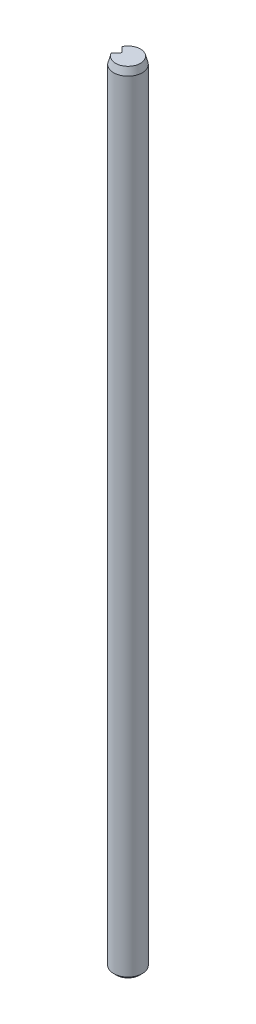
ISO-10303-21;
HEADER;
FILE_DESCRIPTION(('STEP AP214'),'2;1');
FILE_NAME('part.step','',(''),(''),'','','');
FILE_SCHEMA(('AUTOMOTIVE_DESIGN { 1 0 10303 214 1 1 1 1 }'));
ENDSEC;
DATA;
#1=APPLICATION_CONTEXT('core data for automotive mechanical design processes');
#2=APPLICATION_PROTOCOL_DEFINITION('international standard','automotive_design',2000,#1);
#3=PRODUCT_CONTEXT('',#1,'mechanical');
#4=PRODUCT('Part','Part','',(#3));
#5=PRODUCT_RELATED_PRODUCT_CATEGORY('part','',(#4));
#6=PRODUCT_DEFINITION_FORMATION('','',#4);
#7=PRODUCT_DEFINITION_CONTEXT('part definition',#1,'design');
#8=PRODUCT_DEFINITION('design','',#6,#7);
#9=PRODUCT_DEFINITION_SHAPE('','',#8);
#10=(LENGTH_UNIT() NAMED_UNIT(*) SI_UNIT(.MILLI.,.METRE.));
#11=(NAMED_UNIT(*) PLANE_ANGLE_UNIT() SI_UNIT($,.RADIAN.));
#12=(NAMED_UNIT(*) SI_UNIT($,.STERADIAN.) SOLID_ANGLE_UNIT());
#13=UNCERTAINTY_MEASURE_WITH_UNIT(LENGTH_MEASURE(1.E-05),#10,'distance_accuracy_value','');
#14=(GEOMETRIC_REPRESENTATION_CONTEXT(3) GLOBAL_UNCERTAINTY_ASSIGNED_CONTEXT((#13)) GLOBAL_UNIT_ASSIGNED_CONTEXT((#10,
#11,#12)) REPRESENTATION_CONTEXT('',''));
#15=CARTESIAN_POINT('',(0.,0.,0.));
#16=DIRECTION('',(0.,0.,1.));
#17=DIRECTION('',(1.,0.,0.));
#18=AXIS2_PLACEMENT_3D('',#15,#16,#17);
#19=CARTESIAN_POINT('',(0.,55.,0.));
#20=DIRECTION('',(0.,-1.,0.));
#21=DIRECTION('',(0.,0.,-1.));
#22=AXIS2_PLACEMENT_3D('',#19,#20,#21);
#23=CYLINDRICAL_SURFACE('',#22,1.);
#24=DIRECTION('',(0.,1.,0.));
#25=VECTOR('',#24,1.);
#26=CARTESIAN_POINT('',(-0.878280892974548,0.,0.478145033473976));
#27=LINE('',#26,#25);
#28=CARTESIAN_POINT('',(-0.878280892974548,0.199999999999992,0.478145033473976));
#29=VERTEX_POINT('',#28);
#30=CARTESIAN_POINT('',(-0.878280892974548,54.5,0.478145033473976));
#31=VERTEX_POINT('',#30);
#32=EDGE_CURVE('E125',#29,#31,#27,.T.);
#33=ORIENTED_EDGE('',*,*,#32,.F.);
#34=CARTESIAN_POINT('',(0.,0.199999999999992,0.));
#35=DIRECTION('',(0.,1.,0.));
#36=DIRECTION('',(0.,0.,1.));
#37=AXIS2_PLACEMENT_3D('',#34,#35,#36);
#38=CIRCLE('',#37,1.);
#39=CARTESIAN_POINT('',(-0.878280892974548,0.199999999999992,-0.478145033473976));
#40=VERTEX_POINT('',#39);
#41=EDGE_CURVE('E153',#29,#40,#38,.T.);
#42=ORIENTED_EDGE('',*,*,#41,.T.);
#43=DIRECTION('',(0.,1.,0.));
#44=VECTOR('',#43,1.);
#45=CARTESIAN_POINT('',(-0.878280892974548,0.,-0.478145033473976));
#46=LINE('',#45,#44);
#47=CARTESIAN_POINT('',(-0.878280892974548,54.5,-0.478145033473976));
#48=VERTEX_POINT('',#47);
#49=EDGE_CURVE('E111',#40,#48,#46,.T.);
#50=ORIENTED_EDGE('',*,*,#49,.T.);
#51=CARTESIAN_POINT('',(0.,54.5,0.));
#52=DIRECTION('',(0.,1.,0.));
#53=DIRECTION('',(0.,0.,1.));
#54=AXIS2_PLACEMENT_3D('',#51,#52,#53);
#55=CIRCLE('',#54,1.);
#56=EDGE_CURVE('E136',#48,#31,#55,.F.);
#57=ORIENTED_EDGE('',*,*,#56,.T.);
#58=EDGE_LOOP('',(#33,#42,#50,#57));
#59=FACE_BOUND('',#58,.T.);
#60=ADVANCED_FACE('F36',(#59),#23,.T.);
#61=CARTESIAN_POINT('',(0.,55.,0.));
#62=DIRECTION('',(0.,1.,0.));
#63=DIRECTION('',(0.,0.,1.));
#64=AXIS2_PLACEMENT_3D('',#61,#62,#63);
#65=PLANE('',#64);
#66=DIRECTION('',(0.707106781186548,0.,-0.707106781186547));
#67=VECTOR('',#66,1.);
#68=CARTESIAN_POINT('',(-0.400135859500572,55.,0.));
#69=LINE('',#68,#67);
#70=CARTESIAN_POINT('',(-0.778836297480789,55.,0.378700437980217));
#71=VERTEX_POINT('',#70);
#72=CARTESIAN_POINT('',(-0.470846537619226,55.,0.0707106781186547));
#73=VERTEX_POINT('',#72);
#74=EDGE_CURVE('E118',#71,#73,#69,.T.);
#75=ORIENTED_EDGE('',*,*,#74,.F.);
#76=CARTESIAN_POINT('',(0.,55.,0.));
#77=DIRECTION('',(0.,1.,0.));
#78=DIRECTION('',(0.,0.,1.));
#79=AXIS2_PLACEMENT_3D('',#76,#77,#78);
#80=CIRCLE('',#79,0.866025403784434);
#81=CARTESIAN_POINT('',(-0.778836297480789,55.,-0.378700437980217));
#82=VERTEX_POINT('',#81);
#83=EDGE_CURVE('E116',#71,#82,#80,.T.);
#84=ORIENTED_EDGE('',*,*,#83,.T.);
#85=DIRECTION('',(-0.707106781186548,0.,-0.707106781186547));
#86=VECTOR('',#85,1.);
#87=CARTESIAN_POINT('',(-0.878280892974548,55.,-0.478145033473976));
#88=LINE('',#87,#86);
#89=CARTESIAN_POINT('',(-0.470846537619226,55.,-0.0707106781186547));
#90=VERTEX_POINT('',#89);
#91=EDGE_CURVE('E109',#90,#82,#88,.T.);
#92=ORIENTED_EDGE('',*,*,#91,.F.);
#93=CARTESIAN_POINT('',(-0.541557215737881,55.,0.));
#94=DIRECTION('',(0.,1.,0.));
#95=DIRECTION('',(0.,0.,1.));
#96=AXIS2_PLACEMENT_3D('',#93,#94,#95);
#97=CIRCLE('',#96,0.1);
#98=EDGE_CURVE('E94',#90,#73,#97,.F.);
#99=ORIENTED_EDGE('',*,*,#98,.T.);
#100=EDGE_LOOP('',(#75,#84,#92,#99));
#101=FACE_BOUND('',#100,.T.);
#102=ADVANCED_FACE('F114',(#101),#65,.T.);
#103=CARTESIAN_POINT('',(0.,0.,0.));
#104=DIRECTION('',(0.,1.,0.));
#105=DIRECTION('',(0.,0.,1.));
#106=AXIS2_PLACEMENT_3D('',#103,#104,#105);
#107=PLANE('',#106);
#108=DIRECTION('',(-0.707106781186548,0.,-0.707106781186547));
#109=VECTOR('',#108,1.);
#110=CARTESIAN_POINT('',(-0.878280892974548,0.,-0.478145033473976));
#111=LINE('',#110,#109);
#112=CARTESIAN_POINT('',(-0.470846537619226,0.,-0.0707106781186547));
#113=VERTEX_POINT('',#112);
#114=CARTESIAN_POINT('',(-0.729192511947562,0.,-0.32905665244699));
#115=VERTEX_POINT('',#114);
#116=EDGE_CURVE('E110',#113,#115,#111,.T.);
#117=ORIENTED_EDGE('',*,*,#116,.T.);
#118=CARTESIAN_POINT('',(0.,0.,0.));
#119=DIRECTION('',(0.,1.,0.));
#120=DIRECTION('',(0.,0.,1.));
#121=AXIS2_PLACEMENT_3D('',#118,#119,#120);
#122=CIRCLE('',#121,0.800000000000009);
#123=CARTESIAN_POINT('',(-0.729192511947562,0.,0.32905665244699));
#124=VERTEX_POINT('',#123);
#125=EDGE_CURVE('E49',#115,#124,#122,.F.);
#126=ORIENTED_EDGE('',*,*,#125,.T.);
#127=DIRECTION('',(0.707106781186548,0.,-0.707106781186547));
#128=VECTOR('',#127,1.);
#129=CARTESIAN_POINT('',(-0.400135859500572,0.,0.));
#130=LINE('',#129,#128);
#131=CARTESIAN_POINT('',(-0.470846537619226,0.,0.0707106781186547));
#132=VERTEX_POINT('',#131);
#133=EDGE_CURVE('E117',#124,#132,#130,.T.);
#134=ORIENTED_EDGE('',*,*,#133,.T.);
#135=CARTESIAN_POINT('',(-0.541557215737881,0.,0.));
#136=DIRECTION('',(0.,1.,0.));
#137=DIRECTION('',(0.,0.,1.));
#138=AXIS2_PLACEMENT_3D('',#135,#136,#137);
#139=CIRCLE('',#138,0.1);
#140=EDGE_CURVE('E104',#132,#113,#139,.T.);
#141=ORIENTED_EDGE('',*,*,#140,.T.);
#142=EDGE_LOOP('',(#117,#126,#134,#141));
#143=FACE_BOUND('',#142,.T.);
#144=ADVANCED_FACE('F144',(#143),#107,.F.);
#145=CARTESIAN_POINT('',(-0.878280892974548,0.,-0.478145033473976));
#146=DIRECTION('',(0.707106781186547,0.,-0.707106781186548));
#147=DIRECTION('',(-0.707106781186548,0.,-0.707106781186547));
#148=AXIS2_PLACEMENT_3D('',#145,#146,#147);
#149=PLANE('',#148);
#150=ORIENTED_EDGE('',*,*,#49,.F.);
#151=CARTESIAN_POINT('',(-0.878280892974548,0.199999999999992,-0.478145033473976));
#152=CARTESIAN_POINT('',(-0.853560720112385,0.166476995824775,-0.453424860611813));
#153=CARTESIAN_POINT('',(-0.828794369266961,0.133021421270187,-0.428658509766389));
#154=CARTESIAN_POINT('',(-0.791535665449019,0.0830009543926953,-0.391399805948447));
#155=CARTESIAN_POINT('',(-0.779097907516318,0.0663546228998887,-0.378962048015746));
#156=CARTESIAN_POINT('',(-0.754179221522723,0.0331263818504096,-0.354043362022151));
#157=CARTESIAN_POINT('',(-0.741698293048183,0.0165444729142652,-0.341562433547611));
#158=CARTESIAN_POINT('',(-0.729192511947562,0.,-0.32905665244699));
#159=B_SPLINE_CURVE_WITH_KNOTS('',3,(#151,#152,#153,#154,#155,#156,#157,#158),.UNSPECIFIED.,.F.,
.F.,(4,2,2,4),(0.,0.145305985315924,0.217958905103016,0.290612522968146),.UNSPECIFIED.);
#160=EDGE_CURVE('E63',#40,#115,#159,.T.);
#161=ORIENTED_EDGE('',*,*,#160,.T.);
#162=ORIENTED_EDGE('',*,*,#116,.F.);
#163=DIRECTION('',(0.,1.,0.));
#164=VECTOR('',#163,1.);
#165=CARTESIAN_POINT('',(-0.470846537619227,55.,-0.0707106781186547));
#166=LINE('',#165,#164);
#167=EDGE_CURVE('E98',#113,#90,#166,.T.);
#168=ORIENTED_EDGE('',*,*,#167,.T.);
#169=ORIENTED_EDGE('',*,*,#91,.T.);
#170=CARTESIAN_POINT('',(-0.778836297480789,55.,-0.378700437980217));
#171=CARTESIAN_POINT('',(-0.795522766451599,54.9167113590415,-0.395386906951027));
#172=CARTESIAN_POINT('',(-0.812153051098877,54.8334003691738,-0.412017191598305));
#173=CARTESIAN_POINT('',(-0.845301249582123,54.6667337025012,-0.445165390081551));
#174=CARTESIAN_POINT('',(-0.861819163432766,54.5833780257023,-0.461683303932194));
#175=CARTESIAN_POINT('',(-0.878280892974549,54.5,-0.478145033473976));
#176=B_SPLINE_CURVE_WITH_KNOTS('',3,(#170,#171,#172,#173,#174,#175),.UNSPECIFIED.,.F.,.F.,(4,2,
4),(0.,0.259701143449214,0.519402252986724),.UNSPECIFIED.);
#177=EDGE_CURVE('E130',#82,#48,#176,.T.);
#178=ORIENTED_EDGE('',*,*,#177,.T.);
#179=EDGE_LOOP('',(#150,#161,#162,#168,#169,#178));
#180=FACE_BOUND('',#179,.T.);
#181=ADVANCED_FACE('F107',(#180),#149,.F.);
#182=CARTESIAN_POINT('',(-0.400135859500572,0.,0.));
#183=DIRECTION('',(0.707106781186547,0.,0.707106781186548));
#184=DIRECTION('',(0.707106781186548,0.,-0.707106781186547));
#185=AXIS2_PLACEMENT_3D('',#182,#183,#184);
#186=PLANE('',#185);
#187=ORIENTED_EDGE('',*,*,#133,.F.);
#188=CARTESIAN_POINT('',(-0.729192511947562,0.,0.32905665244699));
#189=CARTESIAN_POINT('',(-0.741698293048182,0.0165444729142653,0.341562433547611));
#190=CARTESIAN_POINT('',(-0.754179221522723,0.0331263818504096,0.354043362022152));
#191=CARTESIAN_POINT('',(-0.779097907516318,0.0663546228998887,0.378962048015746));
#192=CARTESIAN_POINT('',(-0.791535665449019,0.0830009543926953,0.391399805948447));
#193=CARTESIAN_POINT('',(-0.828794369266961,0.133021421270187,0.42865850976639));
#194=CARTESIAN_POINT('',(-0.853560720112385,0.166476995824775,0.453424860611813));
#195=CARTESIAN_POINT('',(-0.878280892974548,0.199999999999992,0.478145033473976));
#196=B_SPLINE_CURVE_WITH_KNOTS('',3,(#188,#189,#190,#191,#192,#193,#194,#195),.UNSPECIFIED.,.F.,
.F.,(4,2,2,4),(0.,0.0726536178651295,0.145306537652222,0.290612522968146),.UNSPECIFIED.);
#197=EDGE_CURVE('E11',#124,#29,#196,.T.);
#198=ORIENTED_EDGE('',*,*,#197,.T.);
#199=ORIENTED_EDGE('',*,*,#32,.T.);
#200=CARTESIAN_POINT('',(-0.878280892974548,54.5,0.478145033473976));
#201=CARTESIAN_POINT('',(-0.861819163432765,54.5833780257023,0.461683303932193));
#202=CARTESIAN_POINT('',(-0.845301249582122,54.6667337025012,0.445165390081551));
#203=CARTESIAN_POINT('',(-0.812153051098875,54.8334003691738,0.412017191598304));
#204=CARTESIAN_POINT('',(-0.795522766451598,54.9167113590415,0.395386906951026));
#205=CARTESIAN_POINT('',(-0.778836297480788,55.,0.378700437980216));
#206=B_SPLINE_CURVE_WITH_KNOTS('',3,(#200,#201,#202,#203,#204,#205),.UNSPECIFIED.,.F.,.F.,(4,2,
4),(0.,0.259701109537517,0.519402252986731),.UNSPECIFIED.);
#207=EDGE_CURVE('E155',#31,#71,#206,.T.);
#208=ORIENTED_EDGE('',*,*,#207,.T.);
#209=ORIENTED_EDGE('',*,*,#74,.T.);
#210=DIRECTION('',(0.,1.,0.));
#211=VECTOR('',#210,1.);
#212=CARTESIAN_POINT('',(-0.470846537619226,0.,0.0707106781186548));
#213=LINE('',#212,#211);
#214=EDGE_CURVE('E100',#73,#132,#213,.F.);
#215=ORIENTED_EDGE('',*,*,#214,.T.);
#216=EDGE_LOOP('',(#187,#198,#199,#208,#209,#215));
#217=FACE_BOUND('',#216,.T.);
#218=ADVANCED_FACE('F143',(#217),#186,.F.);
#219=CARTESIAN_POINT('',(-0.541557215737881,0.,0.));
#220=DIRECTION('',(0.,-1.,0.));
#221=DIRECTION('',(0.,0.,-1.));
#222=AXIS2_PLACEMENT_3D('',#219,#220,#221);
#223=CYLINDRICAL_SURFACE('',#222,0.1);
#224=ORIENTED_EDGE('',*,*,#140,.F.);
#225=ORIENTED_EDGE('',*,*,#214,.F.);
#226=ORIENTED_EDGE('',*,*,#98,.F.);
#227=ORIENTED_EDGE('',*,*,#167,.F.);
#228=EDGE_LOOP('',(#224,#225,#226,#227));
#229=FACE_BOUND('',#228,.T.);
#230=ADVANCED_FACE('F97',(#229),#223,.F.);
#231=CARTESIAN_POINT('',(0.,55.,0.));
#232=DIRECTION('',(0.,-1.,0.));
#233=DIRECTION('',(0.,0.,-1.));
#234=AXIS2_PLACEMENT_3D('',#231,#232,#233);
#235=CONICAL_SURFACE('',#234,0.866025403784434,0.261799387799143);
#236=ORIENTED_EDGE('',*,*,#207,.F.);
#237=ORIENTED_EDGE('',*,*,#56,.F.);
#238=ORIENTED_EDGE('',*,*,#177,.F.);
#239=ORIENTED_EDGE('',*,*,#83,.F.);
#240=EDGE_LOOP('',(#236,#237,#238,#239));
#241=FACE_BOUND('',#240,.T.);
#242=ADVANCED_FACE('F138',(#241),#235,.T.);
#243=CARTESIAN_POINT('',(0.,0.199999999999992,0.));
#244=DIRECTION('',(0.,1.,0.));
#245=DIRECTION('',(0.,0.,1.));
#246=AXIS2_PLACEMENT_3D('',#243,#244,#245);
#247=CONICAL_SURFACE('',#246,1.,0.785398163397446);
#248=ORIENTED_EDGE('',*,*,#197,.F.);
#249=ORIENTED_EDGE('',*,*,#125,.F.);
#250=ORIENTED_EDGE('',*,*,#160,.F.);
#251=ORIENTED_EDGE('',*,*,#41,.F.);
#252=EDGE_LOOP('',(#248,#249,#250,#251));
#253=FACE_BOUND('',#252,.T.);
#254=ADVANCED_FACE('F38',(#253),#247,.T.);
#255=CLOSED_SHELL('',(#60,#102,#144,#181,#218,#230,#242,#254));
#256=MANIFOLD_SOLID_BREP('B2',#255);
#257=ADVANCED_BREP_SHAPE_REPRESENTATION('',(#18,#256),#14);
#258=SHAPE_DEFINITION_REPRESENTATION(#9,#257);
ENDSEC;
END-ISO-10303-21;
